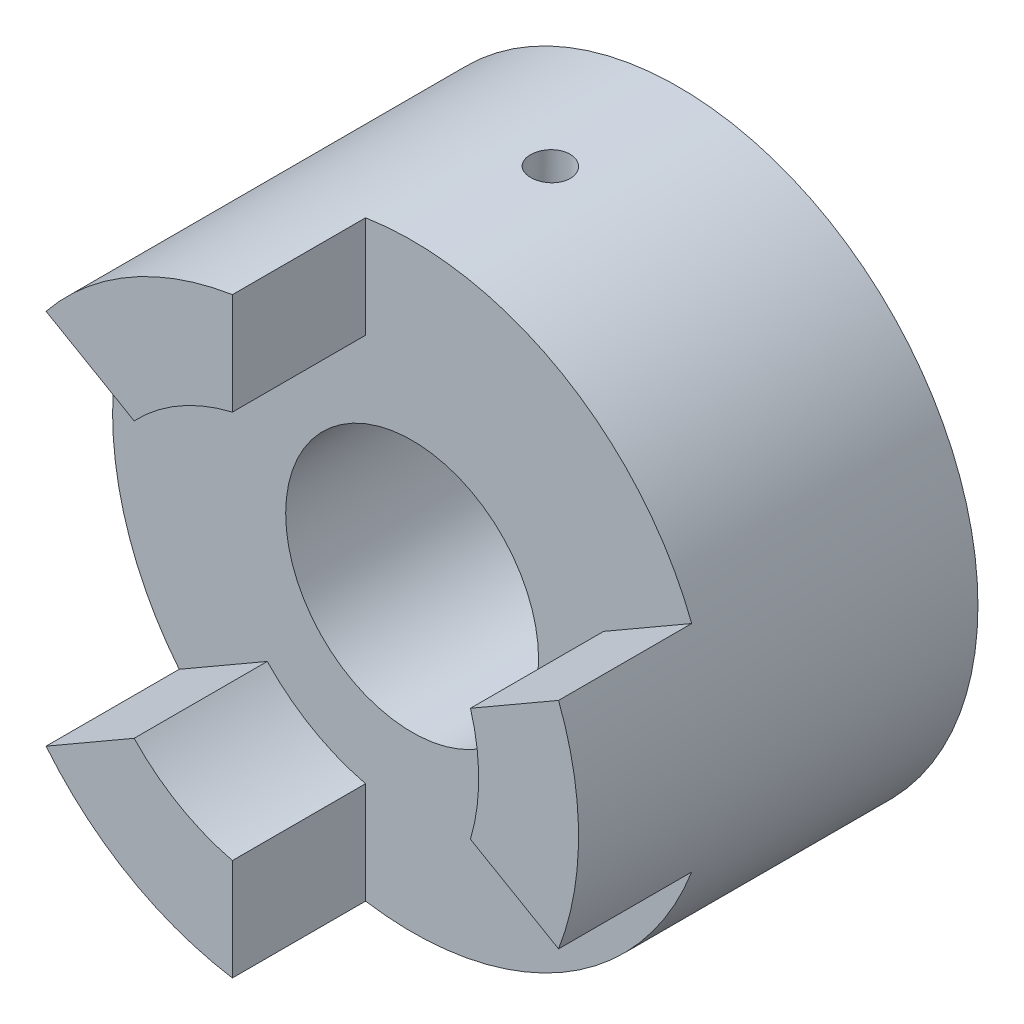
ISO-10303-21;
HEADER;
FILE_DESCRIPTION(('STEP AP214'),'2;1');
FILE_NAME('part.step','',(''),(''),'','','');
FILE_SCHEMA(('AUTOMOTIVE_DESIGN { 1 0 10303 214 1 1 1 1 }'));
ENDSEC;
DATA;
#1=APPLICATION_CONTEXT('core data for automotive mechanical design processes');
#2=APPLICATION_PROTOCOL_DEFINITION('international standard','automotive_design',2000,#1);
#3=PRODUCT_CONTEXT('',#1,'mechanical');
#4=PRODUCT('Part','Part','',(#3));
#5=PRODUCT_RELATED_PRODUCT_CATEGORY('part','',(#4));
#6=PRODUCT_DEFINITION_FORMATION('','',#4);
#7=PRODUCT_DEFINITION_CONTEXT('part definition',#1,'design');
#8=PRODUCT_DEFINITION('design','',#6,#7);
#9=PRODUCT_DEFINITION_SHAPE('','',#8);
#10=(LENGTH_UNIT() NAMED_UNIT(*) SI_UNIT(.MILLI.,.METRE.));
#11=(NAMED_UNIT(*) PLANE_ANGLE_UNIT() SI_UNIT($,.RADIAN.));
#12=(NAMED_UNIT(*) SI_UNIT($,.STERADIAN.) SOLID_ANGLE_UNIT());
#13=UNCERTAINTY_MEASURE_WITH_UNIT(LENGTH_MEASURE(1.E-05),#10,'distance_accuracy_value','');
#14=(GEOMETRIC_REPRESENTATION_CONTEXT(3) GLOBAL_UNCERTAINTY_ASSIGNED_CONTEXT((#13)) GLOBAL_UNIT_ASSIGNED_CONTEXT((#10,
#11,#12)) REPRESENTATION_CONTEXT('',''));
#15=CARTESIAN_POINT('',(0.,0.,0.));
#16=DIRECTION('',(0.,0.,1.));
#17=DIRECTION('',(1.,0.,0.));
#18=AXIS2_PLACEMENT_3D('',#15,#16,#17);
#19=CARTESIAN_POINT('',(0.,0.,20.));
#20=DIRECTION('',(0.,0.,1.));
#21=DIRECTION('',(1.,0.,0.));
#22=AXIS2_PLACEMENT_3D('',#19,#20,#21);
#23=PLANE('',#22);
#24=CARTESIAN_POINT('',(0.,0.,20.));
#25=DIRECTION('',(0.,0.,1.));
#26=DIRECTION('',(1.,0.,0.));
#27=AXIS2_PLACEMENT_3D('',#24,#25,#26);
#28=CIRCLE('',#27,9.5);
#29=CARTESIAN_POINT('',(9.5,0.,20.));
#30=VERTEX_POINT('',#29);
#31=EDGE_CURVE('E245',#30,#30,#28,.T.);
#32=ORIENTED_EDGE('',*,*,#31,.F.);
#33=EDGE_LOOP('',(#32));
#34=FACE_BOUND('',#33,.T.);
#35=CARTESIAN_POINT('',(0.,0.,20.));
#36=DIRECTION('',(0.,0.,-1.));
#37=DIRECTION('',(1.,0.,0.));
#38=AXIS2_PLACEMENT_3D('',#35,#36,#37);
#39=CIRCLE('',#38,15.);
#40=CARTESIAN_POINT('',(-3.5,-14.5859521458148,20.));
#41=VERTEX_POINT('',#40);
#42=CARTESIAN_POINT('',(-10.8818050966599,-10.3240649861528,20.));
#43=VERTEX_POINT('',#42);
#44=EDGE_CURVE('E54',#41,#43,#39,.T.);
#45=ORIENTED_EDGE('',*,*,#44,.F.);
#46=DIRECTION('',(0.,1.,0.));
#47=VECTOR('',#46,1.);
#48=CARTESIAN_POINT('',(-3.5,-14.5859521458148,20.));
#49=LINE('',#48,#47);
#50=CARTESIAN_POINT('',(-3.5,-22.2261107708929,20.));
#51=VERTEX_POINT('',#50);
#52=EDGE_CURVE('E403',#51,#41,#49,.T.);
#53=ORIENTED_EDGE('',*,*,#52,.F.);
#54=CARTESIAN_POINT('',(0.,0.,20.));
#55=DIRECTION('',(0.,0.,1.));
#56=DIRECTION('',(1.,0.,0.));
#57=AXIS2_PLACEMENT_3D('',#54,#55,#56);
#58=CIRCLE('',#57,22.5);
#59=CARTESIAN_POINT('',(20.9983765549201,-8.081966472201,20.));
#60=VERTEX_POINT('',#59);
#61=EDGE_CURVE('E40',#51,#60,#58,.T.);
#62=ORIENTED_EDGE('',*,*,#61,.T.);
#63=DIRECTION('',(0.866025403784436,-0.500000000000004,0.));
#64=VECTOR('',#63,1.);
#65=CARTESIAN_POINT('',(20.9983765549201,-8.081966472201,20.));
#66=LINE('',#65,#64);
#67=CARTESIAN_POINT('',(14.3818050966598,-4.26188715966194,20.));
#68=VERTEX_POINT('',#67);
#69=EDGE_CURVE('E162',#68,#60,#66,.T.);
#70=ORIENTED_EDGE('',*,*,#69,.F.);
#71=CARTESIAN_POINT('',(0.,0.,20.));
#72=DIRECTION('',(0.,0.,-1.));
#73=DIRECTION('',(1.,0.,0.));
#74=AXIS2_PLACEMENT_3D('',#71,#72,#73);
#75=CIRCLE('',#74,15.);
#76=CARTESIAN_POINT('',(14.3818050966598,4.26188715966176,20.));
#77=VERTEX_POINT('',#76);
#78=EDGE_CURVE('E152',#77,#68,#75,.T.);
#79=ORIENTED_EDGE('',*,*,#78,.F.);
#80=DIRECTION('',(-0.866025403784443,-0.499999999999992,0.));
#81=VECTOR('',#80,1.);
#82=CARTESIAN_POINT('',(14.3818050966598,4.26188715966176,20.));
#83=LINE('',#82,#81);
#84=CARTESIAN_POINT('',(20.9983765549202,8.08196647220072,20.));
#85=VERTEX_POINT('',#84);
#86=EDGE_CURVE('E150',#85,#77,#83,.T.);
#87=ORIENTED_EDGE('',*,*,#86,.F.);
#88=CARTESIAN_POINT('',(-3.50000000000001,22.2261107708929,20.));
#89=VERTEX_POINT('',#88);
#90=EDGE_CURVE('E217',#85,#89,#58,.T.);
#91=ORIENTED_EDGE('',*,*,#90,.T.);
#92=DIRECTION('',(0.,1.,0.));
#93=VECTOR('',#92,1.);
#94=CARTESIAN_POINT('',(-3.5,22.2261107708929,20.));
#95=LINE('',#94,#93);
#96=CARTESIAN_POINT('',(-3.5,14.5859521458148,20.));
#97=VERTEX_POINT('',#96);
#98=EDGE_CURVE('E195',#97,#89,#95,.T.);
#99=ORIENTED_EDGE('',*,*,#98,.F.);
#100=CARTESIAN_POINT('',(0.,0.,20.));
#101=DIRECTION('',(0.,0.,-1.));
#102=DIRECTION('',(1.,0.,0.));
#103=AXIS2_PLACEMENT_3D('',#100,#101,#102);
#104=CIRCLE('',#103,15.);
#105=CARTESIAN_POINT('',(-10.8818050966597,10.324064986153,20.));
#106=VERTEX_POINT('',#105);
#107=EDGE_CURVE('E181',#106,#97,#104,.T.);
#108=ORIENTED_EDGE('',*,*,#107,.F.);
#109=DIRECTION('',(0.866025403784436,-0.500000000000004,0.));
#110=VECTOR('',#109,1.);
#111=CARTESIAN_POINT('',(-17.4983765549201,14.1441442986921,20.));
#112=LINE('',#111,#110);
#113=CARTESIAN_POINT('',(-17.4983765549201,14.144144298692,20.));
#114=VERTEX_POINT('',#113);
#115=EDGE_CURVE('E186',#114,#106,#112,.T.);
#116=ORIENTED_EDGE('',*,*,#115,.F.);
#117=CARTESIAN_POINT('',(-17.4983765549203,-14.1441442986918,20.));
#118=VERTEX_POINT('',#117);
#119=EDGE_CURVE('E46',#114,#118,#58,.T.);
#120=ORIENTED_EDGE('',*,*,#119,.T.);
#121=DIRECTION('',(-0.866025403784443,-0.499999999999992,0.));
#122=VECTOR('',#121,1.);
#123=CARTESIAN_POINT('',(-17.4983765549203,-14.1441442986918,20.));
#124=LINE('',#123,#122);
#125=EDGE_CURVE('E59',#43,#118,#124,.T.);
#126=ORIENTED_EDGE('',*,*,#125,.F.);
#127=EDGE_LOOP('',(#45,#53,#62,#70,#79,#87,#91,#99,#108,#116,#120,#126));
#128=FACE_BOUND('',#127,.T.);
#129=ADVANCED_FACE('F35',(#34,#128),#23,.T.);
#130=CARTESIAN_POINT('',(0.,0.,20.));
#131=DIRECTION('',(0.,0.,-1.));
#132=DIRECTION('',(-1.,0.,0.));
#133=AXIS2_PLACEMENT_3D('',#130,#131,#132);
#134=CYLINDRICAL_SURFACE('',#133,22.5);
#135=CARTESIAN_POINT('',(-1.16795072214175,22.4696660213419,9.9509839765561));
#136=CARTESIAN_POINT('',(-1.16794701412822,22.4696666351266,9.86682882468708));
#137=CARTESIAN_POINT('',(-1.16083853462614,22.4700392018296,9.78261503637612));
#138=CARTESIAN_POINT('',(-1.13258449434566,22.471480697484,9.61651364954389));
#139=CARTESIAN_POINT('',(-1.11142267175415,22.4725504331371,9.5346288606282));
#140=CARTESIAN_POINT('',(-1.05567496758904,22.4752380311045,9.37561546316127));
#141=CARTESIAN_POINT('',(-1.02109626483874,22.4768556002368,9.29848433665232));
#142=CARTESIAN_POINT('',(-0.939510841472762,22.4804132200468,9.15113626091315));
#143=CARTESIAN_POINT('',(-0.892506933100566,22.4823531977157,9.08091775205354));
#144=CARTESIAN_POINT('',(-0.787321799091392,22.4862822653723,8.9492495333017));
#145=CARTESIAN_POINT('',(-0.729123980123893,22.488271424401,8.88781308018272));
#146=CARTESIAN_POINT('',(-0.603241089186681,22.4919998434333,8.77556647860183));
#147=CARTESIAN_POINT('',(-0.535555618423458,22.4937390929262,8.72475677703693));
#148=CARTESIAN_POINT('',(-0.392546510837813,22.4966890716028,8.63516458913433));
#149=CARTESIAN_POINT('',(-0.317215933429358,22.4978993151447,8.59639316367709));
#150=CARTESIAN_POINT('',(-0.161106583630494,22.4995584749486,8.53204891038463));
#151=CARTESIAN_POINT('',(-0.0803278761180135,22.500007400275,8.50647592540988));
#152=CARTESIAN_POINT('',(0.0842541461032171,22.4999924287302,8.46929151286395));
#153=CARTESIAN_POINT('',(0.168052740501643,22.499529900542,8.4576591934942));
#154=CARTESIAN_POINT('',(0.336402293717323,22.4976425119387,8.44862178180597));
#155=CARTESIAN_POINT('',(0.420953243062837,22.4962176636219,8.45121651062898));
#156=CARTESIAN_POINT('',(0.588266129708601,22.4924639826339,8.47054233443924));
#157=CARTESIAN_POINT('',(0.67103069653389,22.4901365901524,8.48725095768299));
#158=CARTESIAN_POINT('',(0.832565993292586,22.4847363612551,8.53429538928928));
#159=CARTESIAN_POINT('',(0.911336697020258,22.4816635199487,8.56463128705432));
#160=CARTESIAN_POINT('',(1.06272261164742,22.4750166272793,8.63809451797387));
#161=CARTESIAN_POINT('',(1.13533287297505,22.4714421789089,8.6812320136648));
#162=CARTESIAN_POINT('',(1.2722859030292,22.4641046836031,8.77906653524814));
#163=CARTESIAN_POINT('',(1.33662856545644,22.4603416342438,8.83376370974329));
#164=CARTESIAN_POINT('',(1.45535453244866,22.4529618562286,8.95329180612418));
#165=CARTESIAN_POINT('',(1.50971821721403,22.449345426488,9.01814223651269));
#166=CARTESIAN_POINT('',(1.60679530484671,22.4426064521477,9.15606769541081));
#167=CARTESIAN_POINT('',(1.64950870236193,22.439483907775,9.22914272769877));
#168=CARTESIAN_POINT('',(1.7220745704774,22.4340319588832,9.38145576222379));
#169=CARTESIAN_POINT('',(1.75192618133141,22.4317026073872,9.46069417603434));
#170=CARTESIAN_POINT('',(1.79790975507206,22.4280640531212,9.62307881670943));
#171=CARTESIAN_POINT('',(1.81404190173043,22.4267548366865,9.7062249912139));
#172=CARTESIAN_POINT('',(1.83210546711131,22.4252864697945,9.87389368251136));
#173=CARTESIAN_POINT('',(1.83406414738777,22.4251251115319,9.95841324354472));
#174=CARTESIAN_POINT('',(1.82379660597111,22.4259624418472,10.1265800340995));
#175=CARTESIAN_POINT('',(1.81157046841159,22.4269611235448,10.2102272687919));
#176=CARTESIAN_POINT('',(1.77330198524295,22.430019264112,10.3741975858724));
#177=CARTESIAN_POINT('',(1.74727222536644,22.432077756628,10.4545236246261));
#178=CARTESIAN_POINT('',(1.68214605935868,22.4370551772429,10.60966269689));
#179=CARTESIAN_POINT('',(1.64304951843054,22.4399741142182,10.6844756735177));
#180=CARTESIAN_POINT('',(1.5528271333128,22.4463976750895,10.8265902326363));
#181=CARTESIAN_POINT('',(1.50168303140065,22.4499031855614,10.8938801836915));
#182=CARTESIAN_POINT('',(1.38884040962061,22.4571661269891,11.0189213375547));
#183=CARTESIAN_POINT('',(1.3271417726129,22.4609235607405,11.0766724344814));
#184=CARTESIAN_POINT('',(1.19482048170147,22.4683509312009,11.1810888947149));
#185=CARTESIAN_POINT('',(1.1241838714648,22.4720207201659,11.2277365849532));
#186=CARTESIAN_POINT('',(0.976058442943612,22.4789412520019,11.3085010832813));
#187=CARTESIAN_POINT('',(0.89856967163721,22.4821919977453,11.3426179772733));
#188=CARTESIAN_POINT('',(0.739001568444851,22.4880021362221,11.3973217571046));
#189=CARTESIAN_POINT('',(0.656926076696509,22.4905620971359,11.4179197825061));
#190=CARTESIAN_POINT('',(0.49045958171309,22.4948078152173,11.445037570028));
#191=CARTESIAN_POINT('',(0.40606860499338,22.4964935823911,11.4515574932931));
#192=CARTESIAN_POINT('',(0.237540917170963,22.4989035911875,11.4503323899263));
#193=CARTESIAN_POINT('',(0.153404030342545,22.4996296909851,11.4426150002337));
#194=CARTESIAN_POINT('',(-0.0123898446146695,22.5001493640251,11.4131917004924));
#195=CARTESIAN_POINT('',(-0.094046828527573,22.4999429356823,11.3914857666642));
#196=CARTESIAN_POINT('',(-0.252564896325961,22.4987221590962,11.3347079254833));
#197=CARTESIAN_POINT('',(-0.329426048193699,22.4977078223081,11.2996362076445));
#198=CARTESIAN_POINT('',(-0.476181328642586,22.4950804526772,11.2171260186757));
#199=CARTESIAN_POINT('',(-0.546075625279928,22.4934674342804,11.1696878459523));
#200=CARTESIAN_POINT('',(-0.677050473510534,22.4899068565662,11.0636887007921));
#201=CARTESIAN_POINT('',(-0.738114734161111,22.4879586930601,11.0051076197651));
#202=CARTESIAN_POINT('',(-0.849564286877072,22.4840245335145,10.8785150339242));
#203=CARTESIAN_POINT('',(-0.899946966889859,22.4820385283505,10.8105012291612));
#204=CARTESIAN_POINT('',(-0.9886424430826,22.47831322808,10.666886676364));
#205=CARTESIAN_POINT('',(-1.02693884290122,22.4765742698621,10.5912758037275));
#206=CARTESIAN_POINT('',(-1.09023738754139,22.47359330319,10.4347413302532));
#207=CARTESIAN_POINT('',(-1.11525505244659,22.4723507150045,10.3538240563899));
#208=CARTESIAN_POINT('',(-1.14480459317688,22.4708599339827,10.2188429666264));
#209=CARTESIAN_POINT('',(-1.15347308513632,22.4704146367155,10.165650945378));
#210=CARTESIAN_POINT('',(-1.16504733114898,22.4698174842866,10.0586419413207));
#211=CARTESIAN_POINT('',(-1.16795309446345,22.4696656286533,10.0048249595162));
#212=CARTESIAN_POINT('',(-1.16795072214175,22.4696660213419,9.9509839765561));
#213=B_SPLINE_CURVE_WITH_KNOTS('',3,(#135,#136,#137,#138,#139,#140,#141,#142,#143,#144,#145,
#146,#147,#148,#149,#150,#151,#152,#153,#154,#155,#156,#157,#158,#159,#160,#161,#162,#163,#164,
#165,#166,#167,#168,#169,#170,#171,#172,#173,#174,#175,#176,#177,#178,#179,#180,#181,#182,#183,
#184,#185,#186,#187,#188,#189,#190,#191,#192,#193,#194,#195,#196,#197,#198,#199,#200,#201,#202,
#203,#204,#205,#206,#207,#208,#209,#210,#211,#212),.UNSPECIFIED.,.T.,.F.,(4,2,2,2,2,2,2,2,2,2,2,
2,2,2,2,2,2,2,2,2,2,2,2,2,2,2,2,2,2,2,2,2,2,2,2,2,2,2,4),(0.,0.252268897261408,
0.504830217080159,0.757256587612157,1.0096258743797,1.26237218560875,1.51512912368541,
1.76811761462682,2.02110309343897,2.27370896646024,2.52631166379775,2.7785129306925,
3.03071585219184,3.28311952276676,3.53552643825509,3.78842441965064,4.04132251722657,
4.2942375171565,4.54714912924566,4.7995741560111,5.05199768558994,5.30419145760964,
5.55638783133998,5.80896888837173,6.06155274886383,6.31453599310349,6.567517503036,
6.82029029333925,7.07306019026671,7.32533993592649,7.57762011044376,7.82989670800653,
8.0821672186178,8.33489737367269,8.58768925975639,8.84082262604519,9.09365947683888,
9.25505693053532,9.41645412485044),.UNSPECIFIED.);
#214=CARTESIAN_POINT('',(-1.16795072214175,22.4696660213419,9.9509839765561));
#215=VERTEX_POINT('',#214);
#216=EDGE_CURVE('E11',#215,#215,#213,.T.);
#217=ORIENTED_EDGE('',*,*,#216,.T.);
#218=EDGE_LOOP('',(#217));
#219=FACE_BOUND('',#218,.T.);
#220=ORIENTED_EDGE('',*,*,#119,.F.);
#221=DIRECTION('',(0.,0.,-1.));
#222=VECTOR('',#221,1.);
#223=CARTESIAN_POINT('',(-17.4983765549201,14.1441442986921,30.));
#224=LINE('',#223,#222);
#225=CARTESIAN_POINT('',(-17.4983765549201,14.1441442986921,30.));
#226=VERTEX_POINT('',#225);
#227=EDGE_CURVE('E207',#226,#114,#224,.T.);
#228=ORIENTED_EDGE('',*,*,#227,.F.);
#229=CARTESIAN_POINT('',(0.,0.,30.));
#230=DIRECTION('',(0.,0.,1.));
#231=DIRECTION('',(1.,0.,0.));
#232=AXIS2_PLACEMENT_3D('',#229,#230,#231);
#233=CIRCLE('',#232,22.5);
#234=CARTESIAN_POINT('',(-3.50000000000001,22.2261107708929,30.));
#235=VERTEX_POINT('',#234);
#236=EDGE_CURVE('E188',#235,#226,#233,.T.);
#237=ORIENTED_EDGE('',*,*,#236,.F.);
#238=DIRECTION('',(0.,0.,-1.));
#239=VECTOR('',#238,1.);
#240=CARTESIAN_POINT('',(-3.50000000000001,22.2261107708929,30.));
#241=LINE('',#240,#239);
#242=EDGE_CURVE('E203',#235,#89,#241,.T.);
#243=ORIENTED_EDGE('',*,*,#242,.T.);
#244=ORIENTED_EDGE('',*,*,#90,.F.);
#245=DIRECTION('',(0.,0.,-1.));
#246=VECTOR('',#245,1.);
#247=CARTESIAN_POINT('',(20.9983765549202,8.08196647220072,30.));
#248=LINE('',#247,#246);
#249=CARTESIAN_POINT('',(20.9983765549202,8.08196647220072,30.));
#250=VERTEX_POINT('',#249);
#251=EDGE_CURVE('E179',#250,#85,#248,.T.);
#252=ORIENTED_EDGE('',*,*,#251,.F.);
#253=CARTESIAN_POINT('',(0.,0.,30.));
#254=DIRECTION('',(0.,0.,1.));
#255=DIRECTION('',(1.,0.,0.));
#256=AXIS2_PLACEMENT_3D('',#253,#254,#255);
#257=CIRCLE('',#256,22.5);
#258=CARTESIAN_POINT('',(20.9983765549201,-8.081966472201,30.));
#259=VERTEX_POINT('',#258);
#260=EDGE_CURVE('E158',#259,#250,#257,.T.);
#261=ORIENTED_EDGE('',*,*,#260,.F.);
#262=DIRECTION('',(0.,0.,-1.));
#263=VECTOR('',#262,1.);
#264=CARTESIAN_POINT('',(20.9983765549201,-8.081966472201,30.));
#265=LINE('',#264,#263);
#266=EDGE_CURVE('E167',#259,#60,#265,.T.);
#267=ORIENTED_EDGE('',*,*,#266,.T.);
#268=ORIENTED_EDGE('',*,*,#61,.F.);
#269=DIRECTION('',(0.,0.,-1.));
#270=VECTOR('',#269,1.);
#271=CARTESIAN_POINT('',(-3.5,-22.2261107708929,30.));
#272=LINE('',#271,#270);
#273=CARTESIAN_POINT('',(-3.5,-22.2261107708929,30.));
#274=VERTEX_POINT('',#273);
#275=EDGE_CURVE('E131',#274,#51,#272,.T.);
#276=ORIENTED_EDGE('',*,*,#275,.F.);
#277=CARTESIAN_POINT('',(0.,0.,30.));
#278=DIRECTION('',(0.,0.,1.));
#279=DIRECTION('',(1.,0.,0.));
#280=AXIS2_PLACEMENT_3D('',#277,#278,#279);
#281=CIRCLE('',#280,22.5);
#282=CARTESIAN_POINT('',(-17.4983765549203,-14.1441442986918,30.));
#283=VERTEX_POINT('',#282);
#284=EDGE_CURVE('E137',#283,#274,#281,.T.);
#285=ORIENTED_EDGE('',*,*,#284,.F.);
#286=DIRECTION('',(0.,0.,-1.));
#287=VECTOR('',#286,1.);
#288=CARTESIAN_POINT('',(-17.4983765549203,-14.1441442986918,30.));
#289=LINE('',#288,#287);
#290=EDGE_CURVE('E395',#283,#118,#289,.T.);
#291=ORIENTED_EDGE('',*,*,#290,.T.);
#292=EDGE_LOOP('',(#220,#228,#237,#243,#244,#252,#261,#267,#268,#276,#285,#291));
#293=FACE_BOUND('',#292,.T.);
#294=CARTESIAN_POINT('',(0.,0.,0.));
#295=DIRECTION('',(0.,0.,1.));
#296=DIRECTION('',(1.,0.,0.));
#297=AXIS2_PLACEMENT_3D('',#294,#295,#296);
#298=CIRCLE('',#297,22.5);
#299=CARTESIAN_POINT('',(22.5,0.,0.));
#300=VERTEX_POINT('',#299);
#301=EDGE_CURVE('E218',#300,#300,#298,.T.);
#302=ORIENTED_EDGE('',*,*,#301,.T.);
#303=EDGE_LOOP('',(#302));
#304=FACE_BOUND('',#303,.T.);
#305=ADVANCED_FACE('F37',(#219,#293,#304),#134,.T.);
#306=CARTESIAN_POINT('',(0.,0.,0.));
#307=DIRECTION('',(0.,0.,1.));
#308=DIRECTION('',(1.,0.,0.));
#309=AXIS2_PLACEMENT_3D('',#306,#307,#308);
#310=PLANE('',#309);
#311=CARTESIAN_POINT('',(0.,0.,0.));
#312=DIRECTION('',(0.,0.,1.));
#313=DIRECTION('',(1.,0.,0.));
#314=AXIS2_PLACEMENT_3D('',#311,#312,#313);
#315=CIRCLE('',#314,9.5);
#316=CARTESIAN_POINT('',(9.5,0.,0.));
#317=VERTEX_POINT('',#316);
#318=EDGE_CURVE('E247',#317,#317,#315,.F.);
#319=ORIENTED_EDGE('',*,*,#318,.F.);
#320=EDGE_LOOP('',(#319));
#321=FACE_BOUND('',#320,.T.);
#322=ORIENTED_EDGE('',*,*,#301,.F.);
#323=EDGE_LOOP('',(#322));
#324=FACE_BOUND('',#323,.T.);
#325=ADVANCED_FACE('F254',(#321,#324),#310,.F.);
#326=CARTESIAN_POINT('',(0.,0.,-0.001000000000001));
#327=DIRECTION('',(0.,0.,1.));
#328=DIRECTION('',(1.,0.,0.));
#329=AXIS2_PLACEMENT_3D('',#326,#327,#328);
#330=CYLINDRICAL_SURFACE('',#329,9.5);
#331=CARTESIAN_POINT('',(-1.36115597571916,9.40198140871189,9.9509839765561));
#332=CARTESIAN_POINT('',(-1.36115253914215,9.40198281245498,10.0346742455621));
#333=CARTESIAN_POINT('',(-1.35411224559917,9.40300947241227,10.1184117707957));
#334=CARTESIAN_POINT('',(-1.32614814886704,9.40699329934969,10.283541780249));
#335=CARTESIAN_POINT('',(-1.30521114430422,9.40995230194241,10.3649319577858));
#336=CARTESIAN_POINT('',(-1.25010304295562,9.4174311968943,10.5229533497409));
#337=CARTESIAN_POINT('',(-1.21594251869013,9.42194984197006,10.5995883094175));
#338=CARTESIAN_POINT('',(-1.1353888811009,9.43199512058911,10.7460408867916));
#339=CARTESIAN_POINT('',(-1.08899730967102,9.43752162705037,10.8158593622827));
#340=CARTESIAN_POINT('',(-0.984867533043411,9.44895725764281,10.9473252206433));
#341=CARTESIAN_POINT('',(-0.927042317433202,9.4548690669787,11.0089034608696));
#342=CARTESIAN_POINT('',(-0.801883491296819,9.46630466911595,11.1215410511287));
#343=CARTESIAN_POINT('',(-0.734549339836176,9.47182843981618,11.1725998023333));
#344=CARTESIAN_POINT('',(-0.591846216919601,9.48181698493635,11.2630062325207));
#345=CARTESIAN_POINT('',(-0.516436260280158,9.48627594690666,11.3022899195487));
#346=CARTESIAN_POINT('',(-0.360008976361948,9.4934986500044,11.3676201421814));
#347=CARTESIAN_POINT('',(-0.278991977074463,9.49626249019707,11.3936674513229));
#348=CARTESIAN_POINT('',(-0.114368848571442,9.49966517294385,11.4315750443693));
#349=CARTESIAN_POINT('',(-0.0307897953114429,9.50032146517547,11.4435513033722));
#350=CARTESIAN_POINT('',(0.137178550185515,9.49938067546758,11.4533371860213));
#351=CARTESIAN_POINT('',(0.22156779243625,9.49778373166983,11.4511476781151));
#352=CARTESIAN_POINT('',(0.387969702213226,9.49243650227087,11.4327552047354));
#353=CARTESIAN_POINT('',(0.469996830327012,9.48870549181023,11.4166770287967));
#354=CARTESIAN_POINT('',(0.630145994588965,9.47941739280467,11.3711597848855));
#355=CARTESIAN_POINT('',(0.7082679214915,9.47386025320781,11.3417203433717));
#356=CARTESIAN_POINT('',(0.85876868608471,9.46140833269284,11.2701902204032));
#357=CARTESIAN_POINT('',(0.931122332191321,9.45450809378391,11.2280475194306));
#358=CARTESIAN_POINT('',(1.06776613364092,9.44005315818821,11.1323451930293));
#359=CARTESIAN_POINT('',(1.1320557013435,9.43249841387447,11.0787847363401));
#360=CARTESIAN_POINT('',(1.25148955585435,9.41740112420624,10.9610735004421));
#361=CARTESIAN_POINT('',(1.30652659198367,9.40985960820693,10.8968137137863));
#362=CARTESIAN_POINT('',(1.40506368009421,9.39565230191346,10.759896852389));
#363=CARTESIAN_POINT('',(1.4485636456803,9.3889865181774,10.6872397147698));
#364=CARTESIAN_POINT('',(1.52281685651777,9.37723041347014,10.535473030119));
#365=CARTESIAN_POINT('',(1.55355822839621,9.37214156112977,10.4563575543972));
#366=CARTESIAN_POINT('',(1.60131525597999,9.3641006798062,10.2939845559654));
#367=CARTESIAN_POINT('',(1.61833198942496,9.36114848304206,10.210727359033));
#368=CARTESIAN_POINT('',(1.63801162553281,9.35772504719848,10.0433910208972));
#369=CARTESIAN_POINT('',(1.64082658850659,9.35722752683816,9.95933028533786));
#370=CARTESIAN_POINT('',(1.63242763307638,9.3586963568064,9.79193691762305));
#371=CARTESIAN_POINT('',(1.62121419883702,9.36066262210189,9.70860426043929));
#372=CARTESIAN_POINT('',(1.58520377244347,9.36682743545753,9.5455103071934));
#373=CARTESIAN_POINT('',(1.56048330371513,9.37101340399552,9.46573160484263));
#374=CARTESIAN_POINT('',(1.49823571047918,9.38116614933604,9.31145963583998));
#375=CARTESIAN_POINT('',(1.46070789126177,9.38713302273806,9.23696665616666));
#376=CARTESIAN_POINT('',(1.37354175569231,9.40028374889835,9.09469966123914));
#377=CARTESIAN_POINT('',(1.32380535484661,9.4074773063832,9.02698665095073));
#378=CARTESIAN_POINT('',(1.21376120265728,9.42230644088809,8.90083048796352));
#379=CARTESIAN_POINT('',(1.15345278666418,9.42994204567887,8.84238791852612));
#380=CARTESIAN_POINT('',(1.02329615023264,9.44495568324637,8.73587993862279));
#381=CARTESIAN_POINT('',(0.953364607576278,9.45233066882901,8.68791584279286));
#382=CARTESIAN_POINT('',(0.806332780579432,9.46600607372832,8.60443394532675));
#383=CARTESIAN_POINT('',(0.729232709342689,9.47230652497262,8.56891577385168));
#384=CARTESIAN_POINT('',(0.5703549020701,9.48319590011388,8.51149389638008));
#385=CARTESIAN_POINT('',(0.488597271692454,9.48779161992282,8.48953589466064));
#386=CARTESIAN_POINT('',(0.322467040732424,9.49488929406412,8.45968233858567));
#387=CARTESIAN_POINT('',(0.238094632831243,9.49739140229467,8.451785750549));
#388=CARTESIAN_POINT('',(0.0701085938880571,9.50010873801922,8.45030649043676));
#389=CARTESIAN_POINT('',(-0.0135033191928817,9.50034852137909,8.45656920275451));
#390=CARTESIAN_POINT('',(-0.178500475729958,9.49868131024676,8.48289796673011));
#391=CARTESIAN_POINT('',(-0.259885728661228,9.49677432489117,8.50296395964119));
#392=CARTESIAN_POINT('',(-0.418065365848644,9.49112662040563,8.55627273791535));
#393=CARTESIAN_POINT('',(-0.494863803318522,9.48738754795355,8.58950368550565));
#394=CARTESIAN_POINT('',(-0.641838863729622,9.47857952598807,8.66818226348193));
#395=CARTESIAN_POINT('',(-0.712015225359096,9.47351052402453,8.71363037569364));
#396=CARTESIAN_POINT('',(-0.844529526114883,9.46262342797937,8.81600725291761));
#397=CARTESIAN_POINT('',(-0.906779008068327,9.45679813683462,8.87304976088792));
#398=CARTESIAN_POINT('',(-1.02087771957161,9.44516312502513,8.99675700962073));
#399=CARTESIAN_POINT('',(-1.07272450828576,9.43935340832948,9.0634240023291));
#400=CARTESIAN_POINT('',(-1.16483358776286,9.42843220461251,9.20498240803796));
#401=CARTESIAN_POINT('',(-1.2050211084465,9.42332533000347,9.27992282587012));
#402=CARTESIAN_POINT('',(-1.27215650707061,9.41449808717991,9.43553372880782));
#403=CARTESIAN_POINT('',(-1.29911788892886,9.41077630572344,9.5161982728131));
#404=CARTESIAN_POINT('',(-1.33303232872565,9.40602015513415,9.65616684834494));
#405=CARTESIAN_POINT('',(-1.34356210652009,9.40451443406952,9.71461394254036));
#406=CARTESIAN_POINT('',(-1.35762509474186,9.40249457089038,9.83236077718956));
#407=CARTESIAN_POINT('',(-1.36115841172137,9.40198041367489,9.89166050464435));
#408=CARTESIAN_POINT('',(-1.36115597571916,9.40198140871189,9.9509839765561));
#409=B_SPLINE_CURVE_WITH_KNOTS('',3,(#331,#332,#333,#334,#335,#336,#337,#338,#339,#340,#341,
#342,#343,#344,#345,#346,#347,#348,#349,#350,#351,#352,#353,#354,#355,#356,#357,#358,#359,#360,
#361,#362,#363,#364,#365,#366,#367,#368,#369,#370,#371,#372,#373,#374,#375,#376,#377,#378,#379,
#380,#381,#382,#383,#384,#385,#386,#387,#388,#389,#390,#391,#392,#393,#394,#395,#396,#397,#398,
#399,#400,#401,#402,#403,#404,#405,#406,#407,#408),.UNSPECIFIED.,.T.,.F.,(4,2,2,2,2,2,2,2,2,2,2,
2,2,2,2,2,2,2,2,2,2,2,2,2,2,2,2,2,2,2,2,2,2,2,2,2,2,2,4),(0.,0.250853927262163,
0.501946498416266,0.752838728320955,1.00369934487581,1.2565480788977,1.50941120251429,
1.76362459165416,2.01782312279827,2.26991148848837,2.52198439977626,2.77181572176522,
3.02165402872707,3.2725296457977,3.5234235339093,3.77705047333305,4.03067931198402,
4.28454365571367,4.53838806257508,4.78950866646249,5.0406206036175,5.29032441173716,
5.54004176670725,5.79183509438417,6.04364425767603,6.29778980620818,6.55192780199646,
6.80504150202867,7.05813659442518,7.30848132386846,7.5588249878512,7.80894405482678,
8.05907298755208,8.31178569360904,8.56455762574334,8.81891644248637,9.0730150149629,
9.25083440456599,9.42865108605873),.UNSPECIFIED.);
#410=CARTESIAN_POINT('',(-1.36115597571916,9.40198140871189,9.9509839765561));
#411=VERTEX_POINT('',#410);
#412=EDGE_CURVE('E240',#411,#411,#409,.T.);
#413=ORIENTED_EDGE('',*,*,#412,.T.);
#414=EDGE_LOOP('',(#413));
#415=FACE_BOUND('',#414,.T.);
#416=ORIENTED_EDGE('',*,*,#31,.T.);
#417=EDGE_LOOP('',(#416));
#418=FACE_BOUND('',#417,.T.);
#419=ORIENTED_EDGE('',*,*,#318,.T.);
#420=EDGE_LOOP('',(#419));
#421=FACE_BOUND('',#420,.T.);
#422=ADVANCED_FACE('F233',(#415,#418,#421),#330,.F.);
#423=CARTESIAN_POINT('',(0.332625348918888,22.4975412073688,9.9509839765561));
#424=DIRECTION('',(0.0147833488408394,0.999890720327502,0.));
#425=DIRECTION('',(-0.999890720327502,0.0147833488408394,0.));
#426=AXIS2_PLACEMENT_3D('',#423,#424,#425);
#427=CYLINDRICAL_SURFACE('',#426,1.49999999999999);
#428=ORIENTED_EDGE('',*,*,#216,.F.);
#429=EDGE_LOOP('',(#428));
#430=FACE_BOUND('',#429,.T.);
#431=ORIENTED_EDGE('',*,*,#412,.F.);
#432=EDGE_LOOP('',(#431));
#433=FACE_BOUND('',#432,.T.);
#434=ADVANCED_FACE('F227',(#430,#433),#427,.F.);
#435=CARTESIAN_POINT('',(0.,0.,30.));
#436=DIRECTION('',(0.,0.,-1.));
#437=DIRECTION('',(-1.,0.,0.));
#438=AXIS2_PLACEMENT_3D('',#435,#436,#437);
#439=CYLINDRICAL_SURFACE('',#438,15.);
#440=ORIENTED_EDGE('',*,*,#107,.T.);
#441=DIRECTION('',(0.,0.,-1.));
#442=VECTOR('',#441,1.);
#443=CARTESIAN_POINT('',(-3.5,14.5859521458148,30.));
#444=LINE('',#443,#442);
#445=CARTESIAN_POINT('',(-3.5,14.5859521458148,30.));
#446=VERTEX_POINT('',#445);
#447=EDGE_CURVE('E206',#446,#97,#444,.T.);
#448=ORIENTED_EDGE('',*,*,#447,.F.);
#449=CARTESIAN_POINT('',(0.,0.,30.));
#450=DIRECTION('',(0.,0.,-1.));
#451=DIRECTION('',(1.,0.,0.));
#452=AXIS2_PLACEMENT_3D('',#449,#450,#451);
#453=CIRCLE('',#452,15.);
#454=CARTESIAN_POINT('',(-10.8818050966597,10.324064986153,30.));
#455=VERTEX_POINT('',#454);
#456=EDGE_CURVE('E182',#455,#446,#453,.T.);
#457=ORIENTED_EDGE('',*,*,#456,.F.);
#458=DIRECTION('',(0.,0.,-1.));
#459=VECTOR('',#458,1.);
#460=CARTESIAN_POINT('',(-10.8818050966597,10.324064986153,30.));
#461=LINE('',#460,#459);
#462=EDGE_CURVE('E192',#455,#106,#461,.T.);
#463=ORIENTED_EDGE('',*,*,#462,.T.);
#464=EDGE_LOOP('',(#440,#448,#457,#463));
#465=FACE_BOUND('',#464,.T.);
#466=ADVANCED_FACE('F232',(#465),#439,.F.);
#467=CARTESIAN_POINT('',(-3.5,22.2261107708929,30.));
#468=DIRECTION('',(-1.,0.,0.));
#469=DIRECTION('',(0.,-1.,0.));
#470=AXIS2_PLACEMENT_3D('',#467,#468,#469);
#471=PLANE('',#470);
#472=ORIENTED_EDGE('',*,*,#98,.T.);
#473=ORIENTED_EDGE('',*,*,#242,.F.);
#474=DIRECTION('',(0.,1.,0.));
#475=VECTOR('',#474,1.);
#476=CARTESIAN_POINT('',(-3.5,22.2261107708929,30.));
#477=LINE('',#476,#475);
#478=EDGE_CURVE('E185',#446,#235,#477,.T.);
#479=ORIENTED_EDGE('',*,*,#478,.F.);
#480=ORIENTED_EDGE('',*,*,#447,.T.);
#481=EDGE_LOOP('',(#472,#473,#479,#480));
#482=FACE_BOUND('',#481,.T.);
#483=ADVANCED_FACE('F286',(#482),#471,.F.);
#484=CARTESIAN_POINT('',(-17.4983765549201,14.1441442986921,30.));
#485=DIRECTION('',(0.500000000000004,0.866025403784436,0.));
#486=DIRECTION('',(-0.866025403784436,0.500000000000004,0.));
#487=AXIS2_PLACEMENT_3D('',#484,#485,#486);
#488=PLANE('',#487);
#489=ORIENTED_EDGE('',*,*,#115,.T.);
#490=ORIENTED_EDGE('',*,*,#462,.F.);
#491=DIRECTION('',(0.866025403784436,-0.500000000000004,0.));
#492=VECTOR('',#491,1.);
#493=CARTESIAN_POINT('',(-17.4983765549201,14.1441442986921,30.));
#494=LINE('',#493,#492);
#495=EDGE_CURVE('E190',#226,#455,#494,.T.);
#496=ORIENTED_EDGE('',*,*,#495,.F.);
#497=ORIENTED_EDGE('',*,*,#227,.T.);
#498=EDGE_LOOP('',(#489,#490,#496,#497));
#499=FACE_BOUND('',#498,.T.);
#500=ADVANCED_FACE('F295',(#499),#488,.F.);
#501=CARTESIAN_POINT('',(0.,0.,30.));
#502=DIRECTION('',(0.,0.,1.));
#503=DIRECTION('',(1.,0.,0.));
#504=AXIS2_PLACEMENT_3D('',#501,#502,#503);
#505=PLANE('',#504);
#506=ORIENTED_EDGE('',*,*,#456,.T.);
#507=ORIENTED_EDGE('',*,*,#478,.T.);
#508=ORIENTED_EDGE('',*,*,#236,.T.);
#509=ORIENTED_EDGE('',*,*,#495,.T.);
#510=EDGE_LOOP('',(#506,#507,#508,#509));
#511=FACE_BOUND('',#510,.T.);
#512=ADVANCED_FACE('F304',(#511),#505,.T.);
#513=CARTESIAN_POINT('',(14.3818050966598,4.26188715966176,30.));
#514=DIRECTION('',(0.499999999999992,-0.866025403784443,0.));
#515=DIRECTION('',(0.866025403784443,0.499999999999992,0.));
#516=AXIS2_PLACEMENT_3D('',#513,#514,#515);
#517=PLANE('',#516);
#518=ORIENTED_EDGE('',*,*,#86,.T.);
#519=DIRECTION('',(0.,0.,-1.));
#520=VECTOR('',#519,1.);
#521=CARTESIAN_POINT('',(14.3818050966598,4.26188715966176,30.));
#522=LINE('',#521,#520);
#523=CARTESIAN_POINT('',(14.3818050966598,4.26188715966176,30.));
#524=VERTEX_POINT('',#523);
#525=EDGE_CURVE('E176',#524,#77,#522,.T.);
#526=ORIENTED_EDGE('',*,*,#525,.F.);
#527=DIRECTION('',(-0.866025403784443,-0.499999999999992,0.));
#528=VECTOR('',#527,1.);
#529=CARTESIAN_POINT('',(14.3818050966598,4.26188715966176,30.));
#530=LINE('',#529,#528);
#531=EDGE_CURVE('E161',#250,#524,#530,.T.);
#532=ORIENTED_EDGE('',*,*,#531,.F.);
#533=ORIENTED_EDGE('',*,*,#251,.T.);
#534=EDGE_LOOP('',(#518,#526,#532,#533));
#535=FACE_BOUND('',#534,.T.);
#536=ADVANCED_FACE('F314',(#535),#517,.F.);
#537=CARTESIAN_POINT('',(0.,0.,30.));
#538=DIRECTION('',(0.,0.,-1.));
#539=DIRECTION('',(-1.,0.,0.));
#540=AXIS2_PLACEMENT_3D('',#537,#538,#539);
#541=CYLINDRICAL_SURFACE('',#540,15.);
#542=ORIENTED_EDGE('',*,*,#78,.T.);
#543=DIRECTION('',(0.,0.,-1.));
#544=VECTOR('',#543,1.);
#545=CARTESIAN_POINT('',(14.3818050966598,-4.26188715966194,30.));
#546=LINE('',#545,#544);
#547=CARTESIAN_POINT('',(14.3818050966598,-4.26188715966194,30.));
#548=VERTEX_POINT('',#547);
#549=EDGE_CURVE('E174',#548,#68,#546,.T.);
#550=ORIENTED_EDGE('',*,*,#549,.F.);
#551=CARTESIAN_POINT('',(0.,0.,30.));
#552=DIRECTION('',(0.,0.,-1.));
#553=DIRECTION('',(1.,0.,0.));
#554=AXIS2_PLACEMENT_3D('',#551,#552,#553);
#555=CIRCLE('',#554,15.);
#556=EDGE_CURVE('E164',#524,#548,#555,.T.);
#557=ORIENTED_EDGE('',*,*,#556,.F.);
#558=ORIENTED_EDGE('',*,*,#525,.T.);
#559=EDGE_LOOP('',(#542,#550,#557,#558));
#560=FACE_BOUND('',#559,.T.);
#561=ADVANCED_FACE('F324',(#560),#541,.F.);
#562=CARTESIAN_POINT('',(20.9983765549201,-8.081966472201,30.));
#563=DIRECTION('',(0.500000000000004,0.866025403784436,0.));
#564=DIRECTION('',(-0.866025403784436,0.500000000000004,0.));
#565=AXIS2_PLACEMENT_3D('',#562,#563,#564);
#566=PLANE('',#565);
#567=ORIENTED_EDGE('',*,*,#69,.T.);
#568=ORIENTED_EDGE('',*,*,#266,.F.);
#569=DIRECTION('',(0.866025403784436,-0.500000000000004,0.));
#570=VECTOR('',#569,1.);
#571=CARTESIAN_POINT('',(20.9983765549201,-8.081966472201,30.));
#572=LINE('',#571,#570);
#573=EDGE_CURVE('E166',#548,#259,#572,.T.);
#574=ORIENTED_EDGE('',*,*,#573,.F.);
#575=ORIENTED_EDGE('',*,*,#549,.T.);
#576=EDGE_LOOP('',(#567,#568,#574,#575));
#577=FACE_BOUND('',#576,.T.);
#578=ADVANCED_FACE('F334',(#577),#566,.F.);
#579=CARTESIAN_POINT('',(0.,0.,30.));
#580=DIRECTION('',(0.,0.,1.));
#581=DIRECTION('',(1.,0.,0.));
#582=AXIS2_PLACEMENT_3D('',#579,#580,#581);
#583=PLANE('',#582);
#584=ORIENTED_EDGE('',*,*,#260,.T.);
#585=ORIENTED_EDGE('',*,*,#531,.T.);
#586=ORIENTED_EDGE('',*,*,#556,.T.);
#587=ORIENTED_EDGE('',*,*,#573,.T.);
#588=EDGE_LOOP('',(#584,#585,#586,#587));
#589=FACE_BOUND('',#588,.T.);
#590=ADVANCED_FACE('F344',(#589),#583,.T.);
#591=CARTESIAN_POINT('',(-3.5,-14.5859521458148,30.));
#592=DIRECTION('',(-1.,0.,0.));
#593=DIRECTION('',(0.,-1.,0.));
#594=AXIS2_PLACEMENT_3D('',#591,#592,#593);
#595=PLANE('',#594);
#596=ORIENTED_EDGE('',*,*,#52,.T.);
#597=DIRECTION('',(0.,0.,-1.));
#598=VECTOR('',#597,1.);
#599=CARTESIAN_POINT('',(-3.5,-14.5859521458148,30.));
#600=LINE('',#599,#598);
#601=CARTESIAN_POINT('',(-3.5,-14.5859521458148,30.));
#602=VERTEX_POINT('',#601);
#603=EDGE_CURVE('E133',#602,#41,#600,.T.);
#604=ORIENTED_EDGE('',*,*,#603,.F.);
#605=DIRECTION('',(0.,1.,0.));
#606=VECTOR('',#605,1.);
#607=CARTESIAN_POINT('',(-3.5,-14.5859521458148,30.));
#608=LINE('',#607,#606);
#609=EDGE_CURVE('E127',#274,#602,#608,.T.);
#610=ORIENTED_EDGE('',*,*,#609,.F.);
#611=ORIENTED_EDGE('',*,*,#275,.T.);
#612=EDGE_LOOP('',(#596,#604,#610,#611));
#613=FACE_BOUND('',#612,.T.);
#614=ADVANCED_FACE('F129',(#613),#595,.F.);
#615=CARTESIAN_POINT('',(0.,0.,30.));
#616=DIRECTION('',(0.,0.,-1.));
#617=DIRECTION('',(-1.,0.,0.));
#618=AXIS2_PLACEMENT_3D('',#615,#616,#617);
#619=CYLINDRICAL_SURFACE('',#618,15.);
#620=ORIENTED_EDGE('',*,*,#44,.T.);
#621=DIRECTION('',(0.,0.,-1.));
#622=VECTOR('',#621,1.);
#623=CARTESIAN_POINT('',(-10.8818050966599,-10.3240649861528,30.));
#624=LINE('',#623,#622);
#625=CARTESIAN_POINT('',(-10.8818050966599,-10.3240649861528,30.));
#626=VERTEX_POINT('',#625);
#627=EDGE_CURVE('E154',#626,#43,#624,.T.);
#628=ORIENTED_EDGE('',*,*,#627,.F.);
#629=CARTESIAN_POINT('',(0.,0.,30.));
#630=DIRECTION('',(0.,0.,-1.));
#631=DIRECTION('',(1.,0.,0.));
#632=AXIS2_PLACEMENT_3D('',#629,#630,#631);
#633=CIRCLE('',#632,15.);
#634=EDGE_CURVE('E136',#602,#626,#633,.T.);
#635=ORIENTED_EDGE('',*,*,#634,.F.);
#636=ORIENTED_EDGE('',*,*,#603,.T.);
#637=EDGE_LOOP('',(#620,#628,#635,#636));
#638=FACE_BOUND('',#637,.T.);
#639=ADVANCED_FACE('F363',(#638),#619,.F.);
#640=CARTESIAN_POINT('',(-17.4983765549203,-14.1441442986918,30.));
#641=DIRECTION('',(0.499999999999992,-0.866025403784443,0.));
#642=DIRECTION('',(0.866025403784443,0.499999999999992,0.));
#643=AXIS2_PLACEMENT_3D('',#640,#641,#642);
#644=PLANE('',#643);
#645=ORIENTED_EDGE('',*,*,#125,.T.);
#646=ORIENTED_EDGE('',*,*,#290,.F.);
#647=DIRECTION('',(-0.866025403784443,-0.499999999999992,0.));
#648=VECTOR('',#647,1.);
#649=CARTESIAN_POINT('',(-17.4983765549203,-14.1441442986918,30.));
#650=LINE('',#649,#648);
#651=EDGE_CURVE('E142',#626,#283,#650,.T.);
#652=ORIENTED_EDGE('',*,*,#651,.F.);
#653=ORIENTED_EDGE('',*,*,#627,.T.);
#654=EDGE_LOOP('',(#645,#646,#652,#653));
#655=FACE_BOUND('',#654,.T.);
#656=ADVANCED_FACE('F372',(#655),#644,.F.);
#657=CARTESIAN_POINT('',(0.,0.,30.));
#658=DIRECTION('',(0.,0.,1.));
#659=DIRECTION('',(1.,0.,0.));
#660=AXIS2_PLACEMENT_3D('',#657,#658,#659);
#661=PLANE('',#660);
#662=ORIENTED_EDGE('',*,*,#284,.T.);
#663=ORIENTED_EDGE('',*,*,#609,.T.);
#664=ORIENTED_EDGE('',*,*,#634,.T.);
#665=ORIENTED_EDGE('',*,*,#651,.T.);
#666=EDGE_LOOP('',(#662,#663,#664,#665));
#667=FACE_BOUND('',#666,.T.);
#668=ADVANCED_FACE('F140',(#667),#661,.T.);
#669=CLOSED_SHELL('',(#129,#305,#325,#422,#434,#466,#483,#500,#512,#536,#561,#578,#590,#614,
#639,#656,#668));
#670=MANIFOLD_SOLID_BREP('B2',#669);
#671=ADVANCED_BREP_SHAPE_REPRESENTATION('',(#18,#670),#14);
#672=SHAPE_DEFINITION_REPRESENTATION(#9,#671);
ENDSEC;
END-ISO-10303-21;
